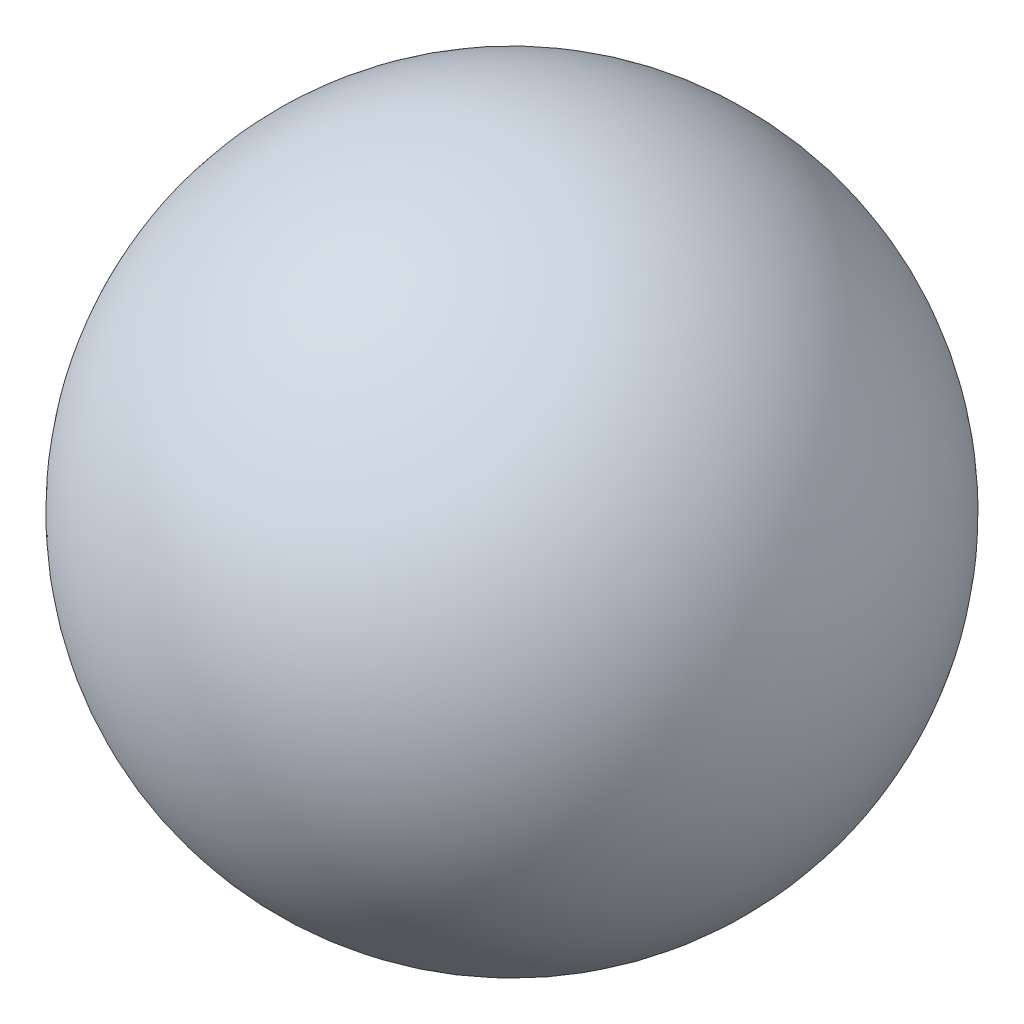
ISO-10303-21;
HEADER;
FILE_DESCRIPTION(('STEP AP214'),'2;1');
FILE_NAME('part.step','',(''),(''),'','','');
FILE_SCHEMA(('AUTOMOTIVE_DESIGN { 1 0 10303 214 1 1 1 1 }'));
ENDSEC;
DATA;
#1=APPLICATION_CONTEXT('core data for automotive mechanical design processes');
#2=APPLICATION_PROTOCOL_DEFINITION('international standard','automotive_design',2000,#1);
#3=PRODUCT_CONTEXT('',#1,'mechanical');
#4=PRODUCT('Part','Part','',(#3));
#5=PRODUCT_RELATED_PRODUCT_CATEGORY('part','',(#4));
#6=PRODUCT_DEFINITION_FORMATION('','',#4);
#7=PRODUCT_DEFINITION_CONTEXT('part definition',#1,'design');
#8=PRODUCT_DEFINITION('design','',#6,#7);
#9=PRODUCT_DEFINITION_SHAPE('','',#8);
#10=(LENGTH_UNIT() NAMED_UNIT(*) SI_UNIT(.MILLI.,.METRE.));
#11=(NAMED_UNIT(*) PLANE_ANGLE_UNIT() SI_UNIT($,.RADIAN.));
#12=(NAMED_UNIT(*) SI_UNIT($,.STERADIAN.) SOLID_ANGLE_UNIT());
#13=UNCERTAINTY_MEASURE_WITH_UNIT(LENGTH_MEASURE(1.E-05),#10,'distance_accuracy_value','');
#14=(GEOMETRIC_REPRESENTATION_CONTEXT(3) GLOBAL_UNCERTAINTY_ASSIGNED_CONTEXT((#13)) GLOBAL_UNIT_ASSIGNED_CONTEXT((#10,
#11,#12)) REPRESENTATION_CONTEXT('',''));
#15=CARTESIAN_POINT('',(0.,0.,0.));
#16=DIRECTION('',(0.,0.,1.));
#17=DIRECTION('',(1.,0.,0.));
#18=AXIS2_PLACEMENT_3D('',#15,#16,#17);
#19=CARTESIAN_POINT('',(0.,0.,0.));
#20=DIRECTION('',(-1.,0.,0.));
#21=DIRECTION('',(0.,1.,0.));
#22=AXIS2_PLACEMENT_3D('',#19,#20,#21);
#23=SPHERICAL_SURFACE('',#22,12.);
#24=CARTESIAN_POINT('',(-12.,0.,0.));
#25=VERTEX_POINT('',#24);
#26=VERTEX_LOOP('',#25);
#27=FACE_BOUND('',#26,.T.);
#28=ADVANCED_FACE('F30',(#27),#23,.T.);
#29=CLOSED_SHELL('',(#28));
#30=MANIFOLD_SOLID_BREP('B2',#29);
#31=ADVANCED_BREP_SHAPE_REPRESENTATION('',(#18,#30),#14);
#32=SHAPE_DEFINITION_REPRESENTATION(#9,#31);
ENDSEC;
END-ISO-10303-21;
